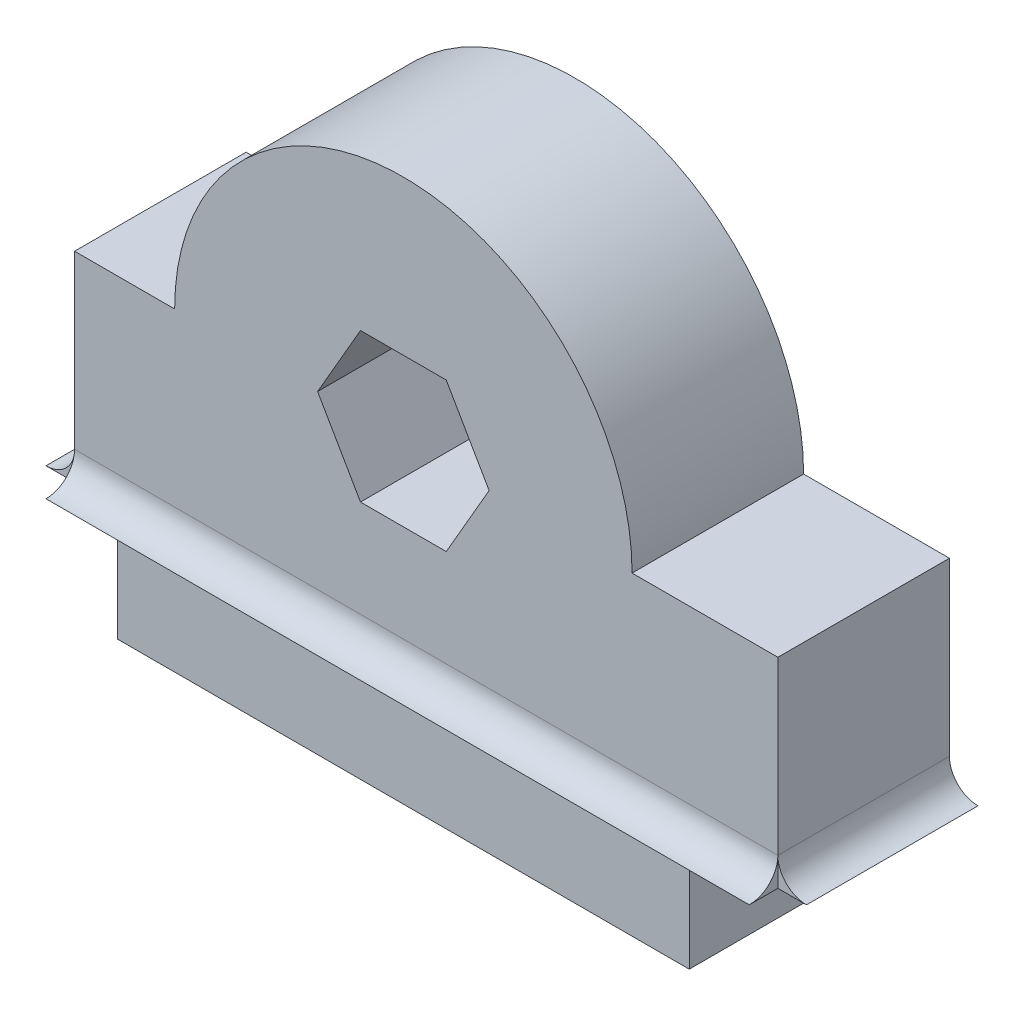
ISO-10303-21;
HEADER;
FILE_DESCRIPTION(('STEP AP214'),'2;1');
FILE_NAME('part.step','',(''),(''),'','','');
FILE_SCHEMA(('AUTOMOTIVE_DESIGN { 1 0 10303 214 1 1 1 1 }'));
ENDSEC;
DATA;
#1=APPLICATION_CONTEXT('core data for automotive mechanical design processes');
#2=APPLICATION_PROTOCOL_DEFINITION('international standard','automotive_design',2000,#1);
#3=PRODUCT_CONTEXT('',#1,'mechanical');
#4=PRODUCT('Part','Part','',(#3));
#5=PRODUCT_RELATED_PRODUCT_CATEGORY('part','',(#4));
#6=PRODUCT_DEFINITION_FORMATION('','',#4);
#7=PRODUCT_DEFINITION_CONTEXT('part definition',#1,'design');
#8=PRODUCT_DEFINITION('design','',#6,#7);
#9=PRODUCT_DEFINITION_SHAPE('','',#8);
#10=(LENGTH_UNIT() NAMED_UNIT(*) SI_UNIT(.MILLI.,.METRE.));
#11=(NAMED_UNIT(*) PLANE_ANGLE_UNIT() SI_UNIT($,.RADIAN.));
#12=(NAMED_UNIT(*) SI_UNIT($,.STERADIAN.) SOLID_ANGLE_UNIT());
#13=UNCERTAINTY_MEASURE_WITH_UNIT(LENGTH_MEASURE(1.E-05),#10,'distance_accuracy_value','');
#14=(GEOMETRIC_REPRESENTATION_CONTEXT(3) GLOBAL_UNCERTAINTY_ASSIGNED_CONTEXT((#13)) GLOBAL_UNIT_ASSIGNED_CONTEXT((#10,
#11,#12)) REPRESENTATION_CONTEXT('',''));
#15=CARTESIAN_POINT('',(0.,0.,0.));
#16=DIRECTION('',(0.,0.,1.));
#17=DIRECTION('',(1.,0.,0.));
#18=AXIS2_PLACEMENT_3D('',#15,#16,#17);
#19=CARTESIAN_POINT('',(-1.5,4.,6.));
#20=DIRECTION('',(1.,0.,0.));
#21=DIRECTION('',(0.,0.,-1.));
#22=AXIS2_PLACEMENT_3D('',#19,#20,#21);
#23=PLANE('',#22);
#24=DIRECTION('',(0.,0.,1.));
#25=VECTOR('',#24,1.);
#26=CARTESIAN_POINT('',(-1.49999999999999,5.,-1.4142135623731));
#27=LINE('',#26,#25);
#28=CARTESIAN_POINT('',(-1.49999999999999,5.,0.));
#29=VERTEX_POINT('',#28);
#30=CARTESIAN_POINT('',(-1.49999999999999,5.,6.));
#31=VERTEX_POINT('',#30);
#32=EDGE_CURVE('E180',#29,#31,#27,.T.);
#33=ORIENTED_EDGE('',*,*,#32,.T.);
#34=DIRECTION('',(0.,-1.,0.));
#35=VECTOR('',#34,1.);
#36=CARTESIAN_POINT('',(-1.5,4.,6.));
#37=LINE('',#36,#35);
#38=CARTESIAN_POINT('',(-1.5,11.,6.));
#39=VERTEX_POINT('',#38);
#40=EDGE_CURVE('E288',#39,#31,#37,.T.);
#41=ORIENTED_EDGE('',*,*,#40,.F.);
#42=DIRECTION('',(0.,0.,-1.));
#43=VECTOR('',#42,1.);
#44=CARTESIAN_POINT('',(-1.5,11.,6.));
#45=LINE('',#44,#43);
#46=CARTESIAN_POINT('',(-1.5,11.,0.));
#47=VERTEX_POINT('',#46);
#48=EDGE_CURVE('E315',#39,#47,#45,.T.);
#49=ORIENTED_EDGE('',*,*,#48,.T.);
#50=DIRECTION('',(0.,-1.,0.));
#51=VECTOR('',#50,1.);
#52=CARTESIAN_POINT('',(-1.5,4.,0.));
#53=LINE('',#52,#51);
#54=EDGE_CURVE('E308',#47,#29,#53,.T.);
#55=ORIENTED_EDGE('',*,*,#54,.T.);
#56=EDGE_LOOP('',(#33,#41,#49,#55));
#57=FACE_BOUND('',#56,.T.);
#58=ADVANCED_FACE('F33',(#57),#23,.F.);
#59=DIRECTION('',(0.,1.,0.));
#60=VECTOR('',#59,1.);
#61=CARTESIAN_POINT('',(-1.5,4.,6.));
#62=LINE('',#61,#60);
#63=CARTESIAN_POINT('',(-1.5,4.,6.));
#64=VERTEX_POINT('',#63);
#65=EDGE_CURVE('E181',#64,#31,#62,.T.);
#66=ORIENTED_EDGE('',*,*,#65,.F.);
#67=DIRECTION('',(0.,0.,-1.));
#68=VECTOR('',#67,1.);
#69=CARTESIAN_POINT('',(-1.5,4.,6.));
#70=LINE('',#69,#68);
#71=CARTESIAN_POINT('',(-1.5,4.,7.));
#72=VERTEX_POINT('',#71);
#73=EDGE_CURVE('E187',#72,#64,#70,.T.);
#74=ORIENTED_EDGE('',*,*,#73,.F.);
#75=CARTESIAN_POINT('',(-1.5,5.,7.));
#76=DIRECTION('',(1.,0.,0.));
#77=DIRECTION('',(0.,0.,1.));
#78=AXIS2_PLACEMENT_3D('',#75,#76,#77);
#79=CIRCLE('',#78,1.);
#80=EDGE_CURVE('E213',#72,#31,#79,.T.);
#81=ORIENTED_EDGE('',*,*,#80,.T.);
#82=EDGE_LOOP('',(#66,#74,#81));
#83=FACE_BOUND('',#82,.T.);
#84=ADVANCED_FACE('F385',(#83),#23,.F.);
#85=CARTESIAN_POINT('',(23.1,11.,6.));
#86=DIRECTION('',(-1.,0.,0.));
#87=DIRECTION('',(0.,0.,1.));
#88=AXIS2_PLACEMENT_3D('',#85,#86,#87);
#89=PLANE('',#88);
#90=DIRECTION('',(0.,1.,0.));
#91=VECTOR('',#90,1.);
#92=CARTESIAN_POINT('',(23.1,11.,6.));
#93=LINE('',#92,#91);
#94=CARTESIAN_POINT('',(23.1,5.,6.));
#95=VERTEX_POINT('',#94);
#96=CARTESIAN_POINT('',(23.1,11.,6.));
#97=VERTEX_POINT('',#96);
#98=EDGE_CURVE('E280',#95,#97,#93,.T.);
#99=ORIENTED_EDGE('',*,*,#98,.F.);
#100=DIRECTION('',(0.,0.,1.));
#101=VECTOR('',#100,1.);
#102=CARTESIAN_POINT('',(23.1,5.,-1.4142135623731));
#103=LINE('',#102,#101);
#104=CARTESIAN_POINT('',(23.1,5.,0.));
#105=VERTEX_POINT('',#104);
#106=EDGE_CURVE('E48',#105,#95,#103,.T.);
#107=ORIENTED_EDGE('',*,*,#106,.F.);
#108=DIRECTION('',(0.,1.,0.));
#109=VECTOR('',#108,1.);
#110=CARTESIAN_POINT('',(23.1,11.,0.));
#111=LINE('',#110,#109);
#112=CARTESIAN_POINT('',(23.1,11.,0.));
#113=VERTEX_POINT('',#112);
#114=EDGE_CURVE('E300',#105,#113,#111,.T.);
#115=ORIENTED_EDGE('',*,*,#114,.T.);
#116=DIRECTION('',(0.,0.,-1.));
#117=VECTOR('',#116,1.);
#118=CARTESIAN_POINT('',(23.1,11.,6.));
#119=LINE('',#118,#117);
#120=EDGE_CURVE('E324',#97,#113,#119,.T.);
#121=ORIENTED_EDGE('',*,*,#120,.F.);
#122=EDGE_LOOP('',(#99,#107,#115,#121));
#123=FACE_BOUND('',#122,.T.);
#124=ADVANCED_FACE('F372',(#123),#89,.F.);
#125=CARTESIAN_POINT('',(10.,11.,6.));
#126=DIRECTION('',(0.,0.,1.));
#127=DIRECTION('',(1.,0.,0.));
#128=AXIS2_PLACEMENT_3D('',#125,#126,#127);
#129=PLANE('',#128);
#130=DIRECTION('',(-0.500000000000001,0.866025403784438,0.));
#131=VECTOR('',#130,1.);
#132=CARTESIAN_POINT('',(13.,11.,6.));
#133=LINE('',#132,#131);
#134=CARTESIAN_POINT('',(13.,11.,6.));
#135=VERTEX_POINT('',#134);
#136=CARTESIAN_POINT('',(11.5,13.5980762113533,6.));
#137=VERTEX_POINT('',#136);
#138=EDGE_CURVE('E229',#135,#137,#133,.T.);
#139=ORIENTED_EDGE('',*,*,#138,.F.);
#140=DIRECTION('',(0.499999999999995,0.866025403784441,0.));
#141=VECTOR('',#140,1.);
#142=CARTESIAN_POINT('',(11.5,8.4019237886467,6.));
#143=LINE('',#142,#141);
#144=CARTESIAN_POINT('',(11.5,8.4019237886467,6.));
#145=VERTEX_POINT('',#144);
#146=EDGE_CURVE('E227',#145,#135,#143,.T.);
#147=ORIENTED_EDGE('',*,*,#146,.F.);
#148=DIRECTION('',(1.,0.,0.));
#149=VECTOR('',#148,1.);
#150=CARTESIAN_POINT('',(8.50000000000002,8.40192378864667,6.));
#151=LINE('',#150,#149);
#152=CARTESIAN_POINT('',(8.50000000000002,8.40192378864667,6.));
#153=VERTEX_POINT('',#152);
#154=EDGE_CURVE('E239',#153,#145,#151,.T.);
#155=ORIENTED_EDGE('',*,*,#154,.F.);
#156=DIRECTION('',(0.500000000000007,-0.866025403784435,0.));
#157=VECTOR('',#156,1.);
#158=CARTESIAN_POINT('',(7.,11.,6.));
#159=LINE('',#158,#157);
#160=CARTESIAN_POINT('',(7.,11.,6.));
#161=VERTEX_POINT('',#160);
#162=EDGE_CURVE('E236',#161,#153,#159,.T.);
#163=ORIENTED_EDGE('',*,*,#162,.F.);
#164=DIRECTION('',(-0.499999999999995,-0.866025403784441,0.));
#165=VECTOR('',#164,1.);
#166=CARTESIAN_POINT('',(8.49999999999999,13.5980762113533,6.));
#167=LINE('',#166,#165);
#168=CARTESIAN_POINT('',(8.49999999999999,13.5980762113533,6.));
#169=VERTEX_POINT('',#168);
#170=EDGE_CURVE('E234',#169,#161,#167,.T.);
#171=ORIENTED_EDGE('',*,*,#170,.F.);
#172=DIRECTION('',(-1.,0.,0.));
#173=VECTOR('',#172,1.);
#174=CARTESIAN_POINT('',(11.5,13.5980762113533,6.));
#175=LINE('',#174,#173);
#176=EDGE_CURVE('E232',#137,#169,#175,.T.);
#177=ORIENTED_EDGE('',*,*,#176,.F.);
#178=EDGE_LOOP('',(#139,#147,#155,#163,#171,#177));
#179=FACE_BOUND('',#178,.T.);
#180=ORIENTED_EDGE('',*,*,#40,.T.);
#181=DIRECTION('',(-1.,0.,0.));
#182=VECTOR('',#181,1.);
#183=CARTESIAN_POINT('',(24.5142135623731,5.,6.));
#184=LINE('',#183,#182);
#185=EDGE_CURVE('E221',#95,#31,#184,.T.);
#186=ORIENTED_EDGE('',*,*,#185,.F.);
#187=ORIENTED_EDGE('',*,*,#98,.T.);
#188=DIRECTION('',(-1.,0.,0.));
#189=VECTOR('',#188,1.);
#190=CARTESIAN_POINT('',(18.,11.,6.));
#191=LINE('',#190,#189);
#192=CARTESIAN_POINT('',(18.,11.,6.));
#193=VERTEX_POINT('',#192);
#194=EDGE_CURVE('E282',#97,#193,#191,.T.);
#195=ORIENTED_EDGE('',*,*,#194,.T.);
#196=CARTESIAN_POINT('',(10.,11.,6.));
#197=DIRECTION('',(0.,0.,1.));
#198=DIRECTION('',(1.,0.,0.));
#199=AXIS2_PLACEMENT_3D('',#196,#197,#198);
#200=CIRCLE('',#199,8.);
#201=CARTESIAN_POINT('',(2.,11.,6.));
#202=VERTEX_POINT('',#201);
#203=EDGE_CURVE('E284',#193,#202,#200,.T.);
#204=ORIENTED_EDGE('',*,*,#203,.T.);
#205=DIRECTION('',(-1.,0.,0.));
#206=VECTOR('',#205,1.);
#207=CARTESIAN_POINT('',(-1.5,11.,6.));
#208=LINE('',#207,#206);
#209=EDGE_CURVE('E286',#202,#39,#208,.T.);
#210=ORIENTED_EDGE('',*,*,#209,.T.);
#211=EDGE_LOOP('',(#180,#186,#187,#195,#204,#210));
#212=FACE_BOUND('',#211,.T.);
#213=ADVANCED_FACE('F392',(#179,#212),#129,.T.);
#214=DIRECTION('',(-1.,0.,0.));
#215=VECTOR('',#214,1.);
#216=CARTESIAN_POINT('',(24.5142135623731,4.,6.));
#217=LINE('',#216,#215);
#218=CARTESIAN_POINT('',(20.,4.,6.));
#219=VERTEX_POINT('',#218);
#220=CARTESIAN_POINT('',(0.,4.,6.));
#221=VERTEX_POINT('',#220);
#222=EDGE_CURVE('E217',#219,#221,#217,.T.);
#223=ORIENTED_EDGE('',*,*,#222,.T.);
#224=DIRECTION('',(0.,-1.,0.));
#225=VECTOR('',#224,1.);
#226=CARTESIAN_POINT('',(0.,0.,6.));
#227=LINE('',#226,#225);
#228=CARTESIAN_POINT('',(0.,0.,6.));
#229=VERTEX_POINT('',#228);
#230=EDGE_CURVE('E272',#221,#229,#227,.T.);
#231=ORIENTED_EDGE('',*,*,#230,.T.);
#232=DIRECTION('',(1.,0.,0.));
#233=VECTOR('',#232,1.);
#234=CARTESIAN_POINT('',(0.,0.,6.));
#235=LINE('',#234,#233);
#236=CARTESIAN_POINT('',(20.,0.,6.));
#237=VERTEX_POINT('',#236);
#238=EDGE_CURVE('E275',#229,#237,#235,.T.);
#239=ORIENTED_EDGE('',*,*,#238,.T.);
#240=DIRECTION('',(0.,1.,0.));
#241=VECTOR('',#240,1.);
#242=CARTESIAN_POINT('',(20.,0.,6.));
#243=LINE('',#242,#241);
#244=EDGE_CURVE('E278',#237,#219,#243,.T.);
#245=ORIENTED_EDGE('',*,*,#244,.T.);
#246=EDGE_LOOP('',(#223,#231,#239,#245));
#247=FACE_BOUND('',#246,.T.);
#248=ADVANCED_FACE('F349',(#247),#129,.T.);
#249=CARTESIAN_POINT('',(10.,11.,0.));
#250=DIRECTION('',(0.,0.,1.));
#251=DIRECTION('',(1.,0.,0.));
#252=AXIS2_PLACEMENT_3D('',#249,#250,#251);
#253=PLANE('',#252);
#254=DIRECTION('',(0.,-1.,0.));
#255=VECTOR('',#254,1.);
#256=CARTESIAN_POINT('',(0.,0.,0.));
#257=LINE('',#256,#255);
#258=CARTESIAN_POINT('',(0.,4.,0.));
#259=VERTEX_POINT('',#258);
#260=CARTESIAN_POINT('',(0.,0.,0.));
#261=VERTEX_POINT('',#260);
#262=EDGE_CURVE('E271',#259,#261,#257,.T.);
#263=ORIENTED_EDGE('',*,*,#262,.F.);
#264=DIRECTION('',(1.,0.,0.));
#265=VECTOR('',#264,1.);
#266=CARTESIAN_POINT('',(0.,4.,0.));
#267=LINE('',#266,#265);
#268=CARTESIAN_POINT('',(-2.5,4.,0.));
#269=VERTEX_POINT('',#268);
#270=EDGE_CURVE('E276',#269,#259,#267,.T.);
#271=ORIENTED_EDGE('',*,*,#270,.F.);
#272=CARTESIAN_POINT('',(-2.5,5.,0.));
#273=DIRECTION('',(0.,0.,1.));
#274=DIRECTION('',(1.,0.,0.));
#275=AXIS2_PLACEMENT_3D('',#272,#273,#274);
#276=CIRCLE('',#275,1.);
#277=EDGE_CURVE('E178',#269,#29,#276,.T.);
#278=ORIENTED_EDGE('',*,*,#277,.T.);
#279=ORIENTED_EDGE('',*,*,#54,.F.);
#280=DIRECTION('',(-1.,0.,0.));
#281=VECTOR('',#280,1.);
#282=CARTESIAN_POINT('',(-1.5,11.,0.));
#283=LINE('',#282,#281);
#284=CARTESIAN_POINT('',(2.,11.,0.));
#285=VERTEX_POINT('',#284);
#286=EDGE_CURVE('E306',#285,#47,#283,.T.);
#287=ORIENTED_EDGE('',*,*,#286,.F.);
#288=CARTESIAN_POINT('',(10.,11.,0.));
#289=DIRECTION('',(0.,0.,1.));
#290=DIRECTION('',(1.,0.,0.));
#291=AXIS2_PLACEMENT_3D('',#288,#289,#290);
#292=CIRCLE('',#291,8.);
#293=CARTESIAN_POINT('',(18.,11.,0.));
#294=VERTEX_POINT('',#293);
#295=EDGE_CURVE('E304',#294,#285,#292,.T.);
#296=ORIENTED_EDGE('',*,*,#295,.F.);
#297=DIRECTION('',(-1.,0.,0.));
#298=VECTOR('',#297,1.);
#299=CARTESIAN_POINT('',(18.,11.,0.));
#300=LINE('',#299,#298);
#301=EDGE_CURVE('E302',#113,#294,#300,.T.);
#302=ORIENTED_EDGE('',*,*,#301,.F.);
#303=ORIENTED_EDGE('',*,*,#114,.F.);
#304=CARTESIAN_POINT('',(24.1,5.,0.));
#305=DIRECTION('',(0.,0.,1.));
#306=DIRECTION('',(1.,0.,0.));
#307=AXIS2_PLACEMENT_3D('',#304,#305,#306);
#308=CIRCLE('',#307,1.);
#309=CARTESIAN_POINT('',(24.1,4.,0.));
#310=VERTEX_POINT('',#309);
#311=EDGE_CURVE('E209',#105,#310,#308,.T.);
#312=ORIENTED_EDGE('',*,*,#311,.T.);
#313=DIRECTION('',(1.,0.,0.));
#314=VECTOR('',#313,1.);
#315=CARTESIAN_POINT('',(23.1,4.,0.));
#316=LINE('',#315,#314);
#317=CARTESIAN_POINT('',(20.,4.,0.));
#318=VERTEX_POINT('',#317);
#319=EDGE_CURVE('E298',#318,#310,#316,.T.);
#320=ORIENTED_EDGE('',*,*,#319,.F.);
#321=DIRECTION('',(0.,1.,0.));
#322=VECTOR('',#321,1.);
#323=CARTESIAN_POINT('',(20.,0.,0.));
#324=LINE('',#323,#322);
#325=CARTESIAN_POINT('',(20.,0.,0.));
#326=VERTEX_POINT('',#325);
#327=EDGE_CURVE('E296',#326,#318,#324,.T.);
#328=ORIENTED_EDGE('',*,*,#327,.F.);
#329=DIRECTION('',(1.,0.,0.));
#330=VECTOR('',#329,1.);
#331=CARTESIAN_POINT('',(0.,0.,0.));
#332=LINE('',#331,#330);
#333=EDGE_CURVE('E294',#261,#326,#332,.T.);
#334=ORIENTED_EDGE('',*,*,#333,.F.);
#335=EDGE_LOOP('',(#263,#271,#278,#279,#287,#296,#302,#303,#312,#320,#328,#334));
#336=FACE_BOUND('',#335,.T.);
#337=DIRECTION('',(0.499999999999995,0.866025403784441,0.));
#338=VECTOR('',#337,1.);
#339=CARTESIAN_POINT('',(11.5,8.4019237886467,0.));
#340=LINE('',#339,#338);
#341=CARTESIAN_POINT('',(11.5,8.4019237886467,0.));
#342=VERTEX_POINT('',#341);
#343=CARTESIAN_POINT('',(13.,11.,0.));
#344=VERTEX_POINT('',#343);
#345=EDGE_CURVE('E226',#342,#344,#340,.T.);
#346=ORIENTED_EDGE('',*,*,#345,.T.);
#347=DIRECTION('',(-0.500000000000001,0.866025403784438,0.));
#348=VECTOR('',#347,1.);
#349=CARTESIAN_POINT('',(13.,11.,0.));
#350=LINE('',#349,#348);
#351=CARTESIAN_POINT('',(11.5,13.5980762113533,0.));
#352=VERTEX_POINT('',#351);
#353=EDGE_CURVE('E244',#344,#352,#350,.T.);
#354=ORIENTED_EDGE('',*,*,#353,.T.);
#355=DIRECTION('',(-1.,0.,0.));
#356=VECTOR('',#355,1.);
#357=CARTESIAN_POINT('',(11.5,13.5980762113533,0.));
#358=LINE('',#357,#356);
#359=CARTESIAN_POINT('',(8.49999999999999,13.5980762113533,0.));
#360=VERTEX_POINT('',#359);
#361=EDGE_CURVE('E247',#352,#360,#358,.T.);
#362=ORIENTED_EDGE('',*,*,#361,.T.);
#363=DIRECTION('',(-0.499999999999995,-0.866025403784441,0.));
#364=VECTOR('',#363,1.);
#365=CARTESIAN_POINT('',(8.49999999999999,13.5980762113533,0.));
#366=LINE('',#365,#364);
#367=CARTESIAN_POINT('',(7.,11.,0.));
#368=VERTEX_POINT('',#367);
#369=EDGE_CURVE('E250',#360,#368,#366,.T.);
#370=ORIENTED_EDGE('',*,*,#369,.T.);
#371=DIRECTION('',(0.500000000000007,-0.866025403784435,0.));
#372=VECTOR('',#371,1.);
#373=CARTESIAN_POINT('',(7.,11.,0.));
#374=LINE('',#373,#372);
#375=CARTESIAN_POINT('',(8.50000000000002,8.40192378864667,0.));
#376=VERTEX_POINT('',#375);
#377=EDGE_CURVE('E253',#368,#376,#374,.T.);
#378=ORIENTED_EDGE('',*,*,#377,.T.);
#379=DIRECTION('',(1.,0.,0.));
#380=VECTOR('',#379,1.);
#381=CARTESIAN_POINT('',(8.50000000000002,8.40192378864667,0.));
#382=LINE('',#381,#380);
#383=EDGE_CURVE('E230',#376,#342,#382,.T.);
#384=ORIENTED_EDGE('',*,*,#383,.T.);
#385=EDGE_LOOP('',(#346,#354,#362,#370,#378,#384));
#386=FACE_BOUND('',#385,.T.);
#387=ADVANCED_FACE('F341',(#336,#386),#253,.F.);
#388=CARTESIAN_POINT('',(0.,0.,6.));
#389=DIRECTION('',(1.,0.,0.));
#390=DIRECTION('',(0.,0.,-1.));
#391=AXIS2_PLACEMENT_3D('',#388,#389,#390);
#392=PLANE('',#391);
#393=ORIENTED_EDGE('',*,*,#262,.T.);
#394=DIRECTION('',(0.,0.,-1.));
#395=VECTOR('',#394,1.);
#396=CARTESIAN_POINT('',(0.,0.,6.));
#397=LINE('',#396,#395);
#398=EDGE_CURVE('E11',#229,#261,#397,.T.);
#399=ORIENTED_EDGE('',*,*,#398,.F.);
#400=ORIENTED_EDGE('',*,*,#230,.F.);
#401=DIRECTION('',(0.,0.,-1.));
#402=VECTOR('',#401,1.);
#403=CARTESIAN_POINT('',(0.,4.,6.));
#404=LINE('',#403,#402);
#405=EDGE_CURVE('E291',#221,#259,#404,.T.);
#406=ORIENTED_EDGE('',*,*,#405,.T.);
#407=EDGE_LOOP('',(#393,#399,#400,#406));
#408=FACE_BOUND('',#407,.T.);
#409=ADVANCED_FACE('F35',(#408),#392,.F.);
#410=CARTESIAN_POINT('',(0.,0.,6.));
#411=DIRECTION('',(0.,1.,0.));
#412=DIRECTION('',(0.,0.,1.));
#413=AXIS2_PLACEMENT_3D('',#410,#411,#412);
#414=PLANE('',#413);
#415=ORIENTED_EDGE('',*,*,#333,.T.);
#416=DIRECTION('',(0.,0.,-1.));
#417=VECTOR('',#416,1.);
#418=CARTESIAN_POINT('',(20.,0.,6.));
#419=LINE('',#418,#417);
#420=EDGE_CURVE('E41',#237,#326,#419,.T.);
#421=ORIENTED_EDGE('',*,*,#420,.F.);
#422=ORIENTED_EDGE('',*,*,#238,.F.);
#423=ORIENTED_EDGE('',*,*,#398,.T.);
#424=EDGE_LOOP('',(#415,#421,#422,#423));
#425=FACE_BOUND('',#424,.T.);
#426=ADVANCED_FACE('F351',(#425),#414,.F.);
#427=CARTESIAN_POINT('',(20.,0.,6.));
#428=DIRECTION('',(-1.,0.,0.));
#429=DIRECTION('',(0.,0.,1.));
#430=AXIS2_PLACEMENT_3D('',#427,#428,#429);
#431=PLANE('',#430);
#432=ORIENTED_EDGE('',*,*,#327,.T.);
#433=DIRECTION('',(0.,0.,-1.));
#434=VECTOR('',#433,1.);
#435=CARTESIAN_POINT('',(20.,4.,6.));
#436=LINE('',#435,#434);
#437=EDGE_CURVE('E328',#219,#318,#436,.T.);
#438=ORIENTED_EDGE('',*,*,#437,.F.);
#439=ORIENTED_EDGE('',*,*,#244,.F.);
#440=ORIENTED_EDGE('',*,*,#420,.T.);
#441=EDGE_LOOP('',(#432,#438,#439,#440));
#442=FACE_BOUND('',#441,.T.);
#443=ADVANCED_FACE('F335',(#442),#431,.F.);
#444=DIRECTION('',(0.,0.,-1.));
#445=VECTOR('',#444,1.);
#446=CARTESIAN_POINT('',(23.1,4.,6.));
#447=LINE('',#446,#445);
#448=CARTESIAN_POINT('',(23.1,4.,7.));
#449=VERTEX_POINT('',#448);
#450=CARTESIAN_POINT('',(23.1,4.,6.));
#451=VERTEX_POINT('',#450);
#452=EDGE_CURVE('E56',#449,#451,#447,.T.);
#453=ORIENTED_EDGE('',*,*,#452,.T.);
#454=DIRECTION('',(0.,-1.,0.));
#455=VECTOR('',#454,1.);
#456=CARTESIAN_POINT('',(23.1,4.,6.));
#457=LINE('',#456,#455);
#458=EDGE_CURVE('E204',#95,#451,#457,.T.);
#459=ORIENTED_EDGE('',*,*,#458,.F.);
#460=CARTESIAN_POINT('',(23.1,5.,7.));
#461=DIRECTION('',(-1.,0.,0.));
#462=DIRECTION('',(0.,0.,1.));
#463=AXIS2_PLACEMENT_3D('',#460,#461,#462);
#464=CIRCLE('',#463,1.);
#465=EDGE_CURVE('E220',#95,#449,#464,.T.);
#466=ORIENTED_EDGE('',*,*,#465,.T.);
#467=EDGE_LOOP('',(#453,#459,#466));
#468=FACE_BOUND('',#467,.T.);
#469=ADVANCED_FACE('F380',(#468),#89,.F.);
#470=CARTESIAN_POINT('',(18.,11.,6.));
#471=DIRECTION('',(0.,-1.,0.));
#472=DIRECTION('',(1.,0.,0.));
#473=AXIS2_PLACEMENT_3D('',#470,#471,#472);
#474=PLANE('',#473);
#475=ORIENTED_EDGE('',*,*,#301,.T.);
#476=DIRECTION('',(0.,0.,-1.));
#477=VECTOR('',#476,1.);
#478=CARTESIAN_POINT('',(18.,11.,6.));
#479=LINE('',#478,#477);
#480=EDGE_CURVE('E321',#193,#294,#479,.T.);
#481=ORIENTED_EDGE('',*,*,#480,.F.);
#482=ORIENTED_EDGE('',*,*,#194,.F.);
#483=ORIENTED_EDGE('',*,*,#120,.T.);
#484=EDGE_LOOP('',(#475,#481,#482,#483));
#485=FACE_BOUND('',#484,.T.);
#486=ADVANCED_FACE('F370',(#485),#474,.F.);
#487=CARTESIAN_POINT('',(10.,11.,6.));
#488=DIRECTION('',(0.,0.,-1.));
#489=DIRECTION('',(-1.,0.,0.));
#490=AXIS2_PLACEMENT_3D('',#487,#488,#489);
#491=CYLINDRICAL_SURFACE('',#490,8.);
#492=ORIENTED_EDGE('',*,*,#295,.T.);
#493=DIRECTION('',(0.,0.,-1.));
#494=VECTOR('',#493,1.);
#495=CARTESIAN_POINT('',(2.,11.,6.));
#496=LINE('',#495,#494);
#497=EDGE_CURVE('E318',#202,#285,#496,.T.);
#498=ORIENTED_EDGE('',*,*,#497,.F.);
#499=ORIENTED_EDGE('',*,*,#203,.F.);
#500=ORIENTED_EDGE('',*,*,#480,.T.);
#501=EDGE_LOOP('',(#492,#498,#499,#500));
#502=FACE_BOUND('',#501,.T.);
#503=ADVANCED_FACE('F365',(#502),#491,.T.);
#504=CARTESIAN_POINT('',(-1.5,11.,6.));
#505=DIRECTION('',(0.,-1.,0.));
#506=DIRECTION('',(0.,0.,-1.));
#507=AXIS2_PLACEMENT_3D('',#504,#505,#506);
#508=PLANE('',#507);
#509=ORIENTED_EDGE('',*,*,#286,.T.);
#510=ORIENTED_EDGE('',*,*,#48,.F.);
#511=ORIENTED_EDGE('',*,*,#209,.F.);
#512=ORIENTED_EDGE('',*,*,#497,.T.);
#513=EDGE_LOOP('',(#509,#510,#511,#512));
#514=FACE_BOUND('',#513,.T.);
#515=ADVANCED_FACE('F360',(#514),#508,.F.);
#516=CARTESIAN_POINT('',(0.,4.,6.));
#517=DIRECTION('',(0.,1.,0.));
#518=DIRECTION('',(0.,0.,1.));
#519=AXIS2_PLACEMENT_3D('',#516,#517,#518);
#520=PLANE('',#519);
#521=ORIENTED_EDGE('',*,*,#270,.T.);
#522=ORIENTED_EDGE('',*,*,#405,.F.);
#523=ORIENTED_EDGE('',*,*,#222,.F.);
#524=ORIENTED_EDGE('',*,*,#437,.T.);
#525=ORIENTED_EDGE('',*,*,#319,.T.);
#526=DIRECTION('',(0.,0.,1.));
#527=VECTOR('',#526,1.);
#528=CARTESIAN_POINT('',(24.1,4.,-1.4142135623731));
#529=LINE('',#528,#527);
#530=CARTESIAN_POINT('',(24.1,4.,6.));
#531=VERTEX_POINT('',#530);
#532=EDGE_CURVE('E207',#310,#531,#529,.T.);
#533=ORIENTED_EDGE('',*,*,#532,.T.);
#534=DIRECTION('',(1.,0.,0.));
#535=VECTOR('',#534,1.);
#536=CARTESIAN_POINT('',(23.1,4.,6.));
#537=LINE('',#536,#535);
#538=EDGE_CURVE('E198',#451,#531,#537,.T.);
#539=ORIENTED_EDGE('',*,*,#538,.F.);
#540=ORIENTED_EDGE('',*,*,#452,.F.);
#541=DIRECTION('',(-1.,0.,0.));
#542=VECTOR('',#541,1.);
#543=CARTESIAN_POINT('',(24.5142135623731,4.,7.));
#544=LINE('',#543,#542);
#545=EDGE_CURVE('E216',#449,#72,#544,.T.);
#546=ORIENTED_EDGE('',*,*,#545,.T.);
#547=ORIENTED_EDGE('',*,*,#73,.T.);
#548=DIRECTION('',(1.,0.,0.));
#549=VECTOR('',#548,1.);
#550=CARTESIAN_POINT('',(-1.5,4.,6.));
#551=LINE('',#550,#549);
#552=CARTESIAN_POINT('',(-2.5,4.,6.));
#553=VERTEX_POINT('',#552);
#554=EDGE_CURVE('E184',#553,#64,#551,.T.);
#555=ORIENTED_EDGE('',*,*,#554,.F.);
#556=DIRECTION('',(0.,0.,1.));
#557=VECTOR('',#556,1.);
#558=CARTESIAN_POINT('',(-2.5,4.,-1.4142135623731));
#559=LINE('',#558,#557);
#560=EDGE_CURVE('E171',#269,#553,#559,.T.);
#561=ORIENTED_EDGE('',*,*,#560,.F.);
#562=EDGE_LOOP('',(#521,#522,#523,#524,#525,#533,#539,#540,#546,#547,#555,#561));
#563=FACE_BOUND('',#562,.T.);
#564=ADVANCED_FACE('F185',(#563),#520,.F.);
#565=CARTESIAN_POINT('',(11.5,8.4019237886467,6.));
#566=DIRECTION('',(-0.866025403784442,0.499999999999995,0.));
#567=DIRECTION('',(-0.499999999999995,-0.866025403784442,0.));
#568=AXIS2_PLACEMENT_3D('',#565,#566,#567);
#569=PLANE('',#568);
#570=ORIENTED_EDGE('',*,*,#345,.F.);
#571=DIRECTION('',(0.,0.,-1.));
#572=VECTOR('',#571,1.);
#573=CARTESIAN_POINT('',(11.5,8.4019237886467,6.));
#574=LINE('',#573,#572);
#575=EDGE_CURVE('E241',#145,#342,#574,.T.);
#576=ORIENTED_EDGE('',*,*,#575,.F.);
#577=ORIENTED_EDGE('',*,*,#146,.T.);
#578=DIRECTION('',(0.,0.,-1.));
#579=VECTOR('',#578,1.);
#580=CARTESIAN_POINT('',(13.,11.,6.));
#581=LINE('',#580,#579);
#582=EDGE_CURVE('E268',#135,#344,#581,.T.);
#583=ORIENTED_EDGE('',*,*,#582,.T.);
#584=EDGE_LOOP('',(#570,#576,#577,#583));
#585=FACE_BOUND('',#584,.T.);
#586=ADVANCED_FACE('F417',(#585),#569,.T.);
#587=CARTESIAN_POINT('',(13.,11.,6.));
#588=DIRECTION('',(-0.866025403784438,-0.500000000000001,0.));
#589=DIRECTION('',(0.500000000000001,-0.866025403784438,0.));
#590=AXIS2_PLACEMENT_3D('',#587,#588,#589);
#591=PLANE('',#590);
#592=ORIENTED_EDGE('',*,*,#353,.F.);
#593=ORIENTED_EDGE('',*,*,#582,.F.);
#594=ORIENTED_EDGE('',*,*,#138,.T.);
#595=DIRECTION('',(0.,0.,-1.));
#596=VECTOR('',#595,1.);
#597=CARTESIAN_POINT('',(11.5,13.5980762113533,6.));
#598=LINE('',#597,#596);
#599=EDGE_CURVE('E266',#137,#352,#598,.T.);
#600=ORIENTED_EDGE('',*,*,#599,.T.);
#601=EDGE_LOOP('',(#592,#593,#594,#600));
#602=FACE_BOUND('',#601,.T.);
#603=ADVANCED_FACE('F420',(#602),#591,.T.);
#604=CARTESIAN_POINT('',(11.5,13.5980762113533,6.));
#605=DIRECTION('',(0.,-1.,0.));
#606=DIRECTION('',(1.,0.,0.));
#607=AXIS2_PLACEMENT_3D('',#604,#605,#606);
#608=PLANE('',#607);
#609=ORIENTED_EDGE('',*,*,#361,.F.);
#610=ORIENTED_EDGE('',*,*,#599,.F.);
#611=ORIENTED_EDGE('',*,*,#176,.T.);
#612=DIRECTION('',(0.,0.,-1.));
#613=VECTOR('',#612,1.);
#614=CARTESIAN_POINT('',(8.49999999999999,13.5980762113533,6.));
#615=LINE('',#614,#613);
#616=EDGE_CURVE('E264',#169,#360,#615,.T.);
#617=ORIENTED_EDGE('',*,*,#616,.T.);
#618=EDGE_LOOP('',(#609,#610,#611,#617));
#619=FACE_BOUND('',#618,.T.);
#620=ADVANCED_FACE('F424',(#619),#608,.T.);
#621=CARTESIAN_POINT('',(8.49999999999999,13.5980762113533,6.));
#622=DIRECTION('',(0.866025403784441,-0.499999999999995,0.));
#623=DIRECTION('',(0.499999999999995,0.866025403784441,0.));
#624=AXIS2_PLACEMENT_3D('',#621,#622,#623);
#625=PLANE('',#624);
#626=ORIENTED_EDGE('',*,*,#369,.F.);
#627=ORIENTED_EDGE('',*,*,#616,.F.);
#628=ORIENTED_EDGE('',*,*,#170,.T.);
#629=DIRECTION('',(0.,0.,-1.));
#630=VECTOR('',#629,1.);
#631=CARTESIAN_POINT('',(7.,11.,6.));
#632=LINE('',#631,#630);
#633=EDGE_CURVE('E262',#161,#368,#632,.T.);
#634=ORIENTED_EDGE('',*,*,#633,.T.);
#635=EDGE_LOOP('',(#626,#627,#628,#634));
#636=FACE_BOUND('',#635,.T.);
#637=ADVANCED_FACE('F428',(#636),#625,.T.);
#638=CARTESIAN_POINT('',(7.,11.,6.));
#639=DIRECTION('',(0.866025403784435,0.500000000000007,0.));
#640=DIRECTION('',(-0.500000000000007,0.866025403784435,0.));
#641=AXIS2_PLACEMENT_3D('',#638,#639,#640);
#642=PLANE('',#641);
#643=ORIENTED_EDGE('',*,*,#377,.F.);
#644=ORIENTED_EDGE('',*,*,#633,.F.);
#645=ORIENTED_EDGE('',*,*,#162,.T.);
#646=DIRECTION('',(0.,0.,-1.));
#647=VECTOR('',#646,1.);
#648=CARTESIAN_POINT('',(8.50000000000002,8.40192378864667,6.));
#649=LINE('',#648,#647);
#650=EDGE_CURVE('E260',#153,#376,#649,.T.);
#651=ORIENTED_EDGE('',*,*,#650,.T.);
#652=EDGE_LOOP('',(#643,#644,#645,#651));
#653=FACE_BOUND('',#652,.T.);
#654=ADVANCED_FACE('F432',(#653),#642,.T.);
#655=CARTESIAN_POINT('',(8.50000000000002,8.40192378864667,6.));
#656=DIRECTION('',(0.,1.,0.));
#657=DIRECTION('',(-1.,0.,0.));
#658=AXIS2_PLACEMENT_3D('',#655,#656,#657);
#659=PLANE('',#658);
#660=ORIENTED_EDGE('',*,*,#383,.F.);
#661=ORIENTED_EDGE('',*,*,#650,.F.);
#662=ORIENTED_EDGE('',*,*,#154,.T.);
#663=ORIENTED_EDGE('',*,*,#575,.T.);
#664=EDGE_LOOP('',(#660,#661,#662,#663));
#665=FACE_BOUND('',#664,.T.);
#666=ADVANCED_FACE('F436',(#665),#659,.T.);
#667=CARTESIAN_POINT('',(24.5142135623731,5.,7.));
#668=DIRECTION('',(-1.,0.,0.));
#669=DIRECTION('',(0.,0.,1.));
#670=AXIS2_PLACEMENT_3D('',#667,#668,#669);
#671=CYLINDRICAL_SURFACE('',#670,1.);
#672=ORIENTED_EDGE('',*,*,#465,.F.);
#673=ORIENTED_EDGE('',*,*,#185,.T.);
#674=ORIENTED_EDGE('',*,*,#80,.F.);
#675=ORIENTED_EDGE('',*,*,#545,.F.);
#676=EDGE_LOOP('',(#672,#673,#674,#675));
#677=FACE_BOUND('',#676,.T.);
#678=ADVANCED_FACE('F383',(#677),#671,.F.);
#679=CARTESIAN_POINT('',(24.1,5.,-1.4142135623731));
#680=DIRECTION('',(0.,0.,1.));
#681=DIRECTION('',(1.,0.,0.));
#682=AXIS2_PLACEMENT_3D('',#679,#680,#681);
#683=CYLINDRICAL_SURFACE('',#682,1.);
#684=ORIENTED_EDGE('',*,*,#311,.F.);
#685=ORIENTED_EDGE('',*,*,#106,.T.);
#686=CARTESIAN_POINT('',(24.1,5.,6.));
#687=DIRECTION('',(0.,0.,-1.));
#688=DIRECTION('',(1.,0.,0.));
#689=AXIS2_PLACEMENT_3D('',#686,#687,#688);
#690=CIRCLE('',#689,1.);
#691=EDGE_CURVE('E201',#531,#95,#690,.T.);
#692=ORIENTED_EDGE('',*,*,#691,.F.);
#693=ORIENTED_EDGE('',*,*,#532,.F.);
#694=EDGE_LOOP('',(#684,#685,#692,#693));
#695=FACE_BOUND('',#694,.T.);
#696=ADVANCED_FACE('F375',(#695),#683,.F.);
#697=CARTESIAN_POINT('',(24.1,5.,6.));
#698=DIRECTION('',(0.,0.,1.));
#699=DIRECTION('',(1.,0.,0.));
#700=AXIS2_PLACEMENT_3D('',#697,#698,#699);
#701=PLANE('',#700);
#702=ORIENTED_EDGE('',*,*,#538,.T.);
#703=ORIENTED_EDGE('',*,*,#691,.T.);
#704=ORIENTED_EDGE('',*,*,#458,.T.);
#705=EDGE_LOOP('',(#702,#703,#704));
#706=FACE_BOUND('',#705,.T.);
#707=ADVANCED_FACE('F377',(#706),#701,.T.);
#708=CARTESIAN_POINT('',(-2.5,5.,-1.4142135623731));
#709=DIRECTION('',(0.,0.,1.));
#710=DIRECTION('',(1.,0.,0.));
#711=AXIS2_PLACEMENT_3D('',#708,#709,#710);
#712=CYLINDRICAL_SURFACE('',#711,1.);
#713=ORIENTED_EDGE('',*,*,#277,.F.);
#714=ORIENTED_EDGE('',*,*,#560,.T.);
#715=CARTESIAN_POINT('',(-2.5,5.,6.));
#716=DIRECTION('',(0.,0.,-1.));
#717=DIRECTION('',(-1.,0.,0.));
#718=AXIS2_PLACEMENT_3D('',#715,#716,#717);
#719=CIRCLE('',#718,1.);
#720=EDGE_CURVE('E176',#31,#553,#719,.T.);
#721=ORIENTED_EDGE('',*,*,#720,.F.);
#722=ORIENTED_EDGE('',*,*,#32,.F.);
#723=EDGE_LOOP('',(#713,#714,#721,#722));
#724=FACE_BOUND('',#723,.T.);
#725=ADVANCED_FACE('F173',(#724),#712,.F.);
#726=CARTESIAN_POINT('',(-2.5,5.,6.));
#727=DIRECTION('',(0.,0.,-1.));
#728=DIRECTION('',(-1.,0.,0.));
#729=AXIS2_PLACEMENT_3D('',#726,#727,#728);
#730=PLANE('',#729);
#731=ORIENTED_EDGE('',*,*,#720,.T.);
#732=ORIENTED_EDGE('',*,*,#554,.T.);
#733=ORIENTED_EDGE('',*,*,#65,.T.);
#734=EDGE_LOOP('',(#731,#732,#733));
#735=FACE_BOUND('',#734,.T.);
#736=ADVANCED_FACE('F191',(#735),#730,.F.);
#737=CLOSED_SHELL('',(#58,#84,#124,#213,#248,#387,#409,#426,#443,#469,#486,#503,#515,#564,#586,
#603,#620,#637,#654,#666,#678,#696,#707,#725,#736));
#738=MANIFOLD_SOLID_BREP('B2',#737);
#739=ADVANCED_BREP_SHAPE_REPRESENTATION('',(#18,#738),#14);
#740=SHAPE_DEFINITION_REPRESENTATION(#9,#739);
ENDSEC;
END-ISO-10303-21;
